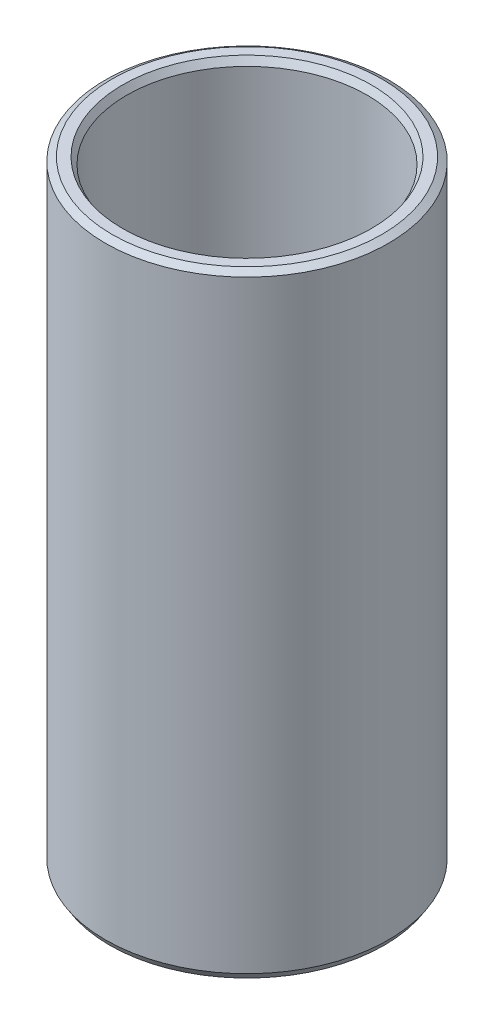
ISO-10303-21;
HEADER;
FILE_DESCRIPTION(('STEP AP214'),'2;1');
FILE_NAME('part.step','',(''),(''),'','','');
FILE_SCHEMA(('AUTOMOTIVE_DESIGN { 1 0 10303 214 1 1 1 1 }'));
ENDSEC;
DATA;
#1=APPLICATION_CONTEXT('core data for automotive mechanical design processes');
#2=APPLICATION_PROTOCOL_DEFINITION('international standard','automotive_design',2000,#1);
#3=PRODUCT_CONTEXT('',#1,'mechanical');
#4=PRODUCT('Part','Part','',(#3));
#5=PRODUCT_RELATED_PRODUCT_CATEGORY('part','',(#4));
#6=PRODUCT_DEFINITION_FORMATION('','',#4);
#7=PRODUCT_DEFINITION_CONTEXT('part definition',#1,'design');
#8=PRODUCT_DEFINITION('design','',#6,#7);
#9=PRODUCT_DEFINITION_SHAPE('','',#8);
#10=(LENGTH_UNIT() NAMED_UNIT(*) SI_UNIT(.MILLI.,.METRE.));
#11=(NAMED_UNIT(*) PLANE_ANGLE_UNIT() SI_UNIT($,.RADIAN.));
#12=(NAMED_UNIT(*) SI_UNIT($,.STERADIAN.) SOLID_ANGLE_UNIT());
#13=UNCERTAINTY_MEASURE_WITH_UNIT(LENGTH_MEASURE(1.E-05),#10,'distance_accuracy_value','');
#14=(GEOMETRIC_REPRESENTATION_CONTEXT(3) GLOBAL_UNCERTAINTY_ASSIGNED_CONTEXT((#13)) GLOBAL_UNIT_ASSIGNED_CONTEXT((#10,
#11,#12)) REPRESENTATION_CONTEXT('',''));
#15=CARTESIAN_POINT('',(0.,0.,0.));
#16=DIRECTION('',(0.,0.,1.));
#17=DIRECTION('',(1.,0.,0.));
#18=AXIS2_PLACEMENT_3D('',#15,#16,#17);
#19=CARTESIAN_POINT('',(0.,97.6144153267064,0.));
#20=DIRECTION('',(0.,-1.,0.));
#21=DIRECTION('',(0.,0.,-1.));
#22=AXIS2_PLACEMENT_3D('',#19,#20,#21);
#23=CYLINDRICAL_SURFACE('',#22,22.5);
#24=CARTESIAN_POINT('',(0.,1.0770015775569,0.));
#25=DIRECTION('',(0.,1.,0.));
#26=DIRECTION('',(0.,0.,1.));
#27=AXIS2_PLACEMENT_3D('',#24,#25,#26);
#28=CIRCLE('',#27,22.5);
#29=CARTESIAN_POINT('',(0.,1.07700157755689,-22.5));
#30=VERTEX_POINT('',#29);
#31=EDGE_CURVE('E10',#30,#30,#28,.T.);
#32=CARTESIAN_POINT('',(0.,96.9454273169921,0.));
#33=DIRECTION('',(0.,1.,0.));
#34=DIRECTION('',(0.,0.,1.));
#35=AXIS2_PLACEMENT_3D('',#32,#33,#34);
#36=CIRCLE('',#35,22.5);
#37=CARTESIAN_POINT('',(0.,96.9454273169921,-22.5));
#38=VERTEX_POINT('',#37);
#39=EDGE_CURVE('E50',#38,#38,#36,.F.);
#40=CARTESIAN_POINT('',(0.,1.07700157755689,-22.5));
#41=CARTESIAN_POINT('',(0.,2.07563101234267,-22.5));
#42=CARTESIAN_POINT('',(0.,3.07426044712845,-22.5));
#43=CARTESIAN_POINT('',(0.,5.07151931670001,-22.5));
#44=CARTESIAN_POINT('',(0.,6.0701487514858,-22.5));
#45=CARTESIAN_POINT('',(0.,8.06740762105736,-22.5));
#46=CARTESIAN_POINT('',(0.,9.06603705584314,-22.5));
#47=CARTESIAN_POINT('',(0.,11.0632959254147,-22.5));
#48=CARTESIAN_POINT('',(0.,12.0619253602005,-22.5));
#49=CARTESIAN_POINT('',(0.,14.0591842297721,-22.5));
#50=CARTESIAN_POINT('',(0.,15.0578136645579,-22.5));
#51=CARTESIAN_POINT('',(0.,17.0550725341294,-22.5));
#52=CARTESIAN_POINT('',(0.,18.0537019689152,-22.5));
#53=CARTESIAN_POINT('',(0.,20.0509608384868,-22.5));
#54=CARTESIAN_POINT('',(0.,21.0495902732725,-22.5));
#55=CARTESIAN_POINT('',(0.,23.0468491428441,-22.5));
#56=CARTESIAN_POINT('',(0.,24.0454785776299,-22.5));
#57=CARTESIAN_POINT('',(0.,26.0427374472015,-22.5));
#58=CARTESIAN_POINT('',(0.,27.0413668819873,-22.5));
#59=CARTESIAN_POINT('',(0.,29.0386257515588,-22.5));
#60=CARTESIAN_POINT('',(0.,30.0372551863446,-22.5));
#61=CARTESIAN_POINT('',(0.,32.0345140559162,-22.5));
#62=CARTESIAN_POINT('',(0.,33.0331434907019,-22.5));
#63=CARTESIAN_POINT('',(0.,35.0304023602735,-22.5));
#64=CARTESIAN_POINT('',(0.,36.0290317950593,-22.5));
#65=CARTESIAN_POINT('',(0.,38.0262906646309,-22.5));
#66=CARTESIAN_POINT('',(0.,39.0249200994166,-22.5));
#67=CARTESIAN_POINT('',(0.,41.0221789689882,-22.5));
#68=CARTESIAN_POINT('',(0.,42.020808403774,-22.5));
#69=CARTESIAN_POINT('',(0.,44.0180672733456,-22.5));
#70=CARTESIAN_POINT('',(0.,45.0166967081313,-22.5));
#71=CARTESIAN_POINT('',(0.,47.0139555777029,-22.5));
#72=CARTESIAN_POINT('',(0.,48.0125850124887,-22.5));
#73=CARTESIAN_POINT('',(0.,50.0098438820603,-22.5));
#74=CARTESIAN_POINT('',(0.,51.008473316846,-22.5));
#75=CARTESIAN_POINT('',(0.,53.0057321864176,-22.5));
#76=CARTESIAN_POINT('',(0.,54.0043616212034,-22.5));
#77=CARTESIAN_POINT('',(0.,56.001620490775,-22.5));
#78=CARTESIAN_POINT('',(0.,57.0002499255607,-22.5));
#79=CARTESIAN_POINT('',(0.,58.9975087951323,-22.5));
#80=CARTESIAN_POINT('',(0.,59.9961382299181,-22.5));
#81=CARTESIAN_POINT('',(0.,61.9933970994897,-22.5));
#82=CARTESIAN_POINT('',(0.,62.9920265342754,-22.5));
#83=CARTESIAN_POINT('',(0.,64.989285403847,-22.5));
#84=CARTESIAN_POINT('',(0.,65.9879148386328,-22.5));
#85=CARTESIAN_POINT('',(0.,67.9851737082043,-22.5));
#86=CARTESIAN_POINT('',(0.,68.9838031429901,-22.5));
#87=CARTESIAN_POINT('',(0.,70.9810620125617,-22.5));
#88=CARTESIAN_POINT('',(0.,71.9796914473475,-22.5));
#89=CARTESIAN_POINT('',(0.,73.976950316919,-22.5));
#90=CARTESIAN_POINT('',(0.,74.9755797517048,-22.5));
#91=CARTESIAN_POINT('',(0.,76.9728386212764,-22.5));
#92=CARTESIAN_POINT('',(0.,77.9714680560622,-22.5));
#93=CARTESIAN_POINT('',(0.,79.9687269256337,-22.5));
#94=CARTESIAN_POINT('',(0.,80.9673563604195,-22.5));
#95=CARTESIAN_POINT('',(0.,82.9646152299911,-22.5));
#96=CARTESIAN_POINT('',(0.,83.9632446647769,-22.5));
#97=CARTESIAN_POINT('',(0.,85.9605035343484,-22.5));
#98=CARTESIAN_POINT('',(0.,86.9591329691342,-22.5));
#99=CARTESIAN_POINT('',(0.,88.9563918387058,-22.5));
#100=CARTESIAN_POINT('',(0.,89.9550212734916,-22.5));
#101=CARTESIAN_POINT('',(0.,91.9522801430631,-22.5));
#102=CARTESIAN_POINT('',(0.,92.9509095778489,-22.5));
#103=CARTESIAN_POINT('',(0.,94.9481684474205,-22.5));
#104=CARTESIAN_POINT('',(0.,95.9467978822063,-22.5));
#105=CARTESIAN_POINT('',(0.,96.9454273169921,-22.5));
#106=B_SPLINE_CURVE_WITH_KNOTS('',3,(#40,#41,#42,#43,#44,#45,#46,#47,#48,#49,#50,#51,#52,#53,
#54,#55,#56,#57,#58,#59,#60,#61,#62,#63,#64,#65,#66,#67,#68,#69,#70,#71,#72,#73,#74,#75,#76,#77,
#78,#79,#80,#81,#82,#83,#84,#85,#86,#87,#88,#89,#90,#91,#92,#93,#94,#95,#96,#97,#98,#99,#100,
#101,#102,#103,#104,#105),.UNSPECIFIED.,.F.,.F.,(4,2,2,2,2,2,2,2,2,2,2,2,2,2,2,2,2,2,2,2,2,2,2,
2,2,2,2,2,2,2,2,2,4),(0.,2.99588830435735,5.99177660871469,8.98766491307204,11.9835532174294,
14.9794415217867,17.9753298261441,20.9712181305014,23.9671064348588,26.9629947392161,
29.9588830435735,32.9547713479308,35.9506596522882,38.9465479566455,41.9424362610029,
44.9383245653602,47.9342128697176,50.9301011740749,53.9259894784323,56.9218777827896,
59.917766087147,62.9136543915043,65.9095426958617,68.905431000219,71.9013193045764,
74.8972076089337,77.8930959132911,80.8889842176484,83.8848725220058,86.8807608263631,
89.8766491307205,92.8725374350778,95.8684257394352),.UNSPECIFIED.);
#107=EDGE_CURVE('BSEAM39',#30,#38,#106,.T.);
#108=ORIENTED_EDGE('',*,*,#31,.T.);
#109=ORIENTED_EDGE('',*,*,#39,.T.);
#110=ORIENTED_EDGE('',*,*,#107,.T.);
#111=ORIENTED_EDGE('',*,*,#107,.F.);
#112=EDGE_LOOP('',(#108,#110,#109,#111));
#113=FACE_BOUND('',#112,.T.);
#114=ADVANCED_FACE('F39',(#113),#23,.T.);
#115=CARTESIAN_POINT('',(0.,97.6144153267064,0.));
#116=DIRECTION('',(0.,1.,0.));
#117=DIRECTION('',(0.,0.,1.));
#118=AXIS2_PLACEMENT_3D('',#115,#116,#117);
#119=PLANE('',#118);
#120=CARTESIAN_POINT('',(0.,97.6144153267064,0.));
#121=DIRECTION('',(0.,1.,0.));
#122=DIRECTION('',(0.,0.,1.));
#123=AXIS2_PLACEMENT_3D('',#120,#121,#122);
#124=CIRCLE('',#123,19.7793494607597);
#125=CARTESIAN_POINT('',(0.,97.6144153267064,19.7793494607597));
#126=VERTEX_POINT('',#125);
#127=EDGE_CURVE('E58',#126,#126,#124,.F.);
#128=ORIENTED_EDGE('',*,*,#127,.T.);
#129=EDGE_LOOP('',(#128));
#130=FACE_BOUND('',#129,.T.);
#131=CARTESIAN_POINT('',(0.,97.6144153267064,0.));
#132=DIRECTION('',(0.,1.,0.));
#133=DIRECTION('',(0.,0.,1.));
#134=AXIS2_PLACEMENT_3D('',#131,#132,#133);
#135=CIRCLE('',#134,21.4229984224433);
#136=CARTESIAN_POINT('',(0.,97.6144153267064,-21.4229984224433));
#137=VERTEX_POINT('',#136);
#138=EDGE_CURVE('E61',#137,#137,#135,.T.);
#139=ORIENTED_EDGE('',*,*,#138,.T.);
#140=EDGE_LOOP('',(#139));
#141=FACE_BOUND('',#140,.T.);
#142=ADVANCED_FACE('F88',(#130,#141),#119,.T.);
#143=CARTESIAN_POINT('',(0.,0.,0.));
#144=DIRECTION('',(0.,1.,0.));
#145=DIRECTION('',(0.,0.,1.));
#146=AXIS2_PLACEMENT_3D('',#143,#144,#145);
#147=PLANE('',#146);
#148=CARTESIAN_POINT('',(0.,0.,0.));
#149=DIRECTION('',(0.,1.,0.));
#150=DIRECTION('',(0.,0.,1.));
#151=AXIS2_PLACEMENT_3D('',#148,#149,#150);
#152=CIRCLE('',#151,20.1873630286019);
#153=CARTESIAN_POINT('',(0.,0.,20.1873630286019));
#154=VERTEX_POINT('',#153);
#155=EDGE_CURVE('E51',#154,#154,#152,.T.);
#156=ORIENTED_EDGE('',*,*,#155,.T.);
#157=EDGE_LOOP('',(#156));
#158=FACE_BOUND('',#157,.T.);
#159=CARTESIAN_POINT('',(0.,0.,0.));
#160=DIRECTION('',(0.,1.,0.));
#161=DIRECTION('',(0.,0.,1.));
#162=AXIS2_PLACEMENT_3D('',#159,#160,#161);
#163=CIRCLE('',#162,21.8310119902855);
#164=CARTESIAN_POINT('',(0.,0.,21.8310119902855));
#165=VERTEX_POINT('',#164);
#166=EDGE_CURVE('E54',#165,#165,#163,.F.);
#167=ORIENTED_EDGE('',*,*,#166,.T.);
#168=EDGE_LOOP('',(#167));
#169=FACE_BOUND('',#168,.T.);
#170=ADVANCED_FACE('F83',(#158,#169),#147,.F.);
#171=CARTESIAN_POINT('',(0.,97.6144153267064,0.));
#172=DIRECTION('',(0.,-1.,0.));
#173=DIRECTION('',(0.,0.,-1.));
#174=AXIS2_PLACEMENT_3D('',#171,#172,#173);
#175=CYLINDRICAL_SURFACE('',#174,19.1103614510452);
#176=CARTESIAN_POINT('',(0.,96.5374137491494,0.));
#177=DIRECTION('',(0.,1.,0.));
#178=DIRECTION('',(0.,0.,1.));
#179=AXIS2_PLACEMENT_3D('',#176,#177,#178);
#180=CIRCLE('',#179,19.1103614510452);
#181=CARTESIAN_POINT('',(0.,96.5374137491494,-19.1103614510452));
#182=VERTEX_POINT('',#181);
#183=EDGE_CURVE('E67',#182,#182,#180,.T.);
#184=CARTESIAN_POINT('',(0.,0.668988009714391,0.));
#185=DIRECTION('',(0.,1.,0.));
#186=DIRECTION('',(0.,0.,1.));
#187=AXIS2_PLACEMENT_3D('',#184,#185,#186);
#188=CIRCLE('',#187,19.1103614510452);
#189=CARTESIAN_POINT('',(0.,0.668988009714377,-19.1103614510452));
#190=VERTEX_POINT('',#189);
#191=EDGE_CURVE('E69',#190,#190,#188,.F.);
#192=CARTESIAN_POINT('',(0.,96.5374137491494,-19.1103614510452));
#193=CARTESIAN_POINT('',(0.,95.5387843143637,-19.1103614510452));
#194=CARTESIAN_POINT('',(0.,94.5401548795779,-19.1103614510452));
#195=CARTESIAN_POINT('',(0.,92.5428960100063,-19.1103614510452));
#196=CARTESIAN_POINT('',(0.,91.5442665752205,-19.1103614510452));
#197=CARTESIAN_POINT('',(0.,89.547007705649,-19.1103614510452));
#198=CARTESIAN_POINT('',(0.,88.5483782708632,-19.1103614510452));
#199=CARTESIAN_POINT('',(0.,86.5511194012916,-19.1103614510452));
#200=CARTESIAN_POINT('',(0.,85.5524899665058,-19.1103614510452));
#201=CARTESIAN_POINT('',(0.,83.5552310969343,-19.1103614510452));
#202=CARTESIAN_POINT('',(0.,82.5566016621485,-19.1103614510452));
#203=CARTESIAN_POINT('',(0.,80.5593427925769,-19.1103614510452));
#204=CARTESIAN_POINT('',(0.,79.5607133577911,-19.1103614510452));
#205=CARTESIAN_POINT('',(0.,77.5634544882196,-19.1103614510452));
#206=CARTESIAN_POINT('',(0.,76.5648250534338,-19.1103614510452));
#207=CARTESIAN_POINT('',(0.,74.5675661838622,-19.1103614510452));
#208=CARTESIAN_POINT('',(0.,73.5689367490764,-19.1103614510452));
#209=CARTESIAN_POINT('',(0.,71.5716778795049,-19.1103614510452));
#210=CARTESIAN_POINT('',(0.,70.5730484447191,-19.1103614510452));
#211=CARTESIAN_POINT('',(0.,68.5757895751475,-19.1103614510452));
#212=CARTESIAN_POINT('',(0.,67.5771601403617,-19.1103614510452));
#213=CARTESIAN_POINT('',(0.,65.5799012707902,-19.1103614510452));
#214=CARTESIAN_POINT('',(0.,64.5812718360044,-19.1103614510452));
#215=CARTESIAN_POINT('',(0.,62.5840129664329,-19.1103614510452));
#216=CARTESIAN_POINT('',(0.,61.5853835316471,-19.1103614510452));
#217=CARTESIAN_POINT('',(0.,59.5881246620755,-19.1103614510452));
#218=CARTESIAN_POINT('',(0.,58.5894952272897,-19.1103614510452));
#219=CARTESIAN_POINT('',(0.,56.5922363577182,-19.1103614510452));
#220=CARTESIAN_POINT('',(0.,55.5936069229324,-19.1103614510452));
#221=CARTESIAN_POINT('',(0.,53.5963480533608,-19.1103614510452));
#222=CARTESIAN_POINT('',(0.,52.597718618575,-19.1103614510452));
#223=CARTESIAN_POINT('',(0.,50.6004597490035,-19.1103614510452));
#224=CARTESIAN_POINT('',(0.,49.6018303142177,-19.1103614510452));
#225=CARTESIAN_POINT('',(0.,47.6045714446461,-19.1103614510452));
#226=CARTESIAN_POINT('',(0.,46.6059420098603,-19.1103614510452));
#227=CARTESIAN_POINT('',(0.,44.6086831402888,-19.1103614510452));
#228=CARTESIAN_POINT('',(0.,43.610053705503,-19.1103614510452));
#229=CARTESIAN_POINT('',(0.,41.6127948359314,-19.1103614510452));
#230=CARTESIAN_POINT('',(0.,40.6141654011456,-19.1103614510452));
#231=CARTESIAN_POINT('',(0.,38.6169065315741,-19.1103614510452));
#232=CARTESIAN_POINT('',(0.,37.6182770967883,-19.1103614510452));
#233=CARTESIAN_POINT('',(0.,35.6210182272167,-19.1103614510452));
#234=CARTESIAN_POINT('',(0.,34.622388792431,-19.1103614510452));
#235=CARTESIAN_POINT('',(0.,32.6251299228594,-19.1103614510452));
#236=CARTESIAN_POINT('',(0.,31.6265004880736,-19.1103614510452));
#237=CARTESIAN_POINT('',(0.,29.629241618502,-19.1103614510452));
#238=CARTESIAN_POINT('',(0.,28.6306121837163,-19.1103614510452));
#239=CARTESIAN_POINT('',(0.,26.6333533141447,-19.1103614510452));
#240=CARTESIAN_POINT('',(0.,25.6347238793589,-19.1103614510452));
#241=CARTESIAN_POINT('',(0.,23.6374650097874,-19.1103614510452));
#242=CARTESIAN_POINT('',(0.,22.6388355750016,-19.1103614510452));
#243=CARTESIAN_POINT('',(0.,20.64157670543,-19.1103614510452));
#244=CARTESIAN_POINT('',(0.,19.6429472706442,-19.1103614510452));
#245=CARTESIAN_POINT('',(0.,17.6456884010727,-19.1103614510452));
#246=CARTESIAN_POINT('',(0.,16.6470589662869,-19.1103614510452));
#247=CARTESIAN_POINT('',(0.,14.6498000967153,-19.1103614510452));
#248=CARTESIAN_POINT('',(0.,13.6511706619295,-19.1103614510452));
#249=CARTESIAN_POINT('',(0.,11.653911792358,-19.1103614510452));
#250=CARTESIAN_POINT('',(0.,10.6552823575722,-19.1103614510452));
#251=CARTESIAN_POINT('',(0.,8.65802348800064,-19.1103614510452));
#252=CARTESIAN_POINT('',(0.,7.65939405321485,-19.1103614510452));
#253=CARTESIAN_POINT('',(0.,5.66213518364329,-19.1103614510452));
#254=CARTESIAN_POINT('',(0.,4.66350574885751,-19.1103614510452));
#255=CARTESIAN_POINT('',(0.,2.66624687928594,-19.1103614510452));
#256=CARTESIAN_POINT('',(0.,1.66761744450016,-19.1103614510452));
#257=CARTESIAN_POINT('',(0.,0.668988009714377,-19.1103614510452));
#258=B_SPLINE_CURVE_WITH_KNOTS('',3,(#192,#193,#194,#195,#196,#197,#198,#199,#200,#201,#202,
#203,#204,#205,#206,#207,#208,#209,#210,#211,#212,#213,#214,#215,#216,#217,#218,#219,#220,#221,
#222,#223,#224,#225,#226,#227,#228,#229,#230,#231,#232,#233,#234,#235,#236,#237,#238,#239,#240,
#241,#242,#243,#244,#245,#246,#247,#248,#249,#250,#251,#252,#253,#254,#255,#256,#257),
.UNSPECIFIED.,.F.,.F.,(4,2,2,2,2,2,2,2,2,2,2,2,2,2,2,2,2,2,2,2,2,2,2,2,2,2,2,2,2,2,2,2,4),(0.,
2.99588830435735,5.99177660871469,8.98766491307204,11.9835532174294,14.9794415217867,
17.9753298261441,20.9712181305014,23.9671064348588,26.9629947392161,29.9588830435735,
32.9547713479308,35.9506596522882,38.9465479566455,41.9424362610028,44.9383245653602,
47.9342128697175,50.9301011740749,53.9259894784322,56.9218777827896,59.9177660871469,
62.9136543915043,65.9095426958616,68.905431000219,71.9013193045763,74.8972076089336,
77.893095913291,80.8889842176483,83.8848725220057,86.880760826363,89.8766491307204,
92.8725374350777,95.8684257394351),.UNSPECIFIED.);
#259=EDGE_CURVE('BSEAM71',#182,#190,#258,.T.);
#260=ORIENTED_EDGE('',*,*,#183,.T.);
#261=ORIENTED_EDGE('',*,*,#191,.T.);
#262=ORIENTED_EDGE('',*,*,#259,.T.);
#263=ORIENTED_EDGE('',*,*,#259,.F.);
#264=EDGE_LOOP('',(#260,#262,#261,#263));
#265=FACE_BOUND('',#264,.T.);
#266=ADVANCED_FACE('F71',(#265),#175,.F.);
#267=CARTESIAN_POINT('',(0.,96.5374137491494,0.));
#268=DIRECTION('',(0.,1.,0.));
#269=DIRECTION('',(0.,0.,1.));
#270=AXIS2_PLACEMENT_3D('',#267,#268,#269);
#271=CONICAL_SURFACE('',#270,19.1103614510452,0.555831665770734);
#272=ORIENTED_EDGE('',*,*,#127,.F.);
#273=EDGE_LOOP('',(#272));
#274=FACE_BOUND('',#273,.T.);
#275=ORIENTED_EDGE('',*,*,#183,.F.);
#276=EDGE_LOOP('',(#275));
#277=FACE_BOUND('',#276,.T.);
#278=ADVANCED_FACE('F77',(#274,#277),#271,.F.);
#279=CARTESIAN_POINT('',(0.,0.,0.));
#280=DIRECTION('',(0.,-1.,0.));
#281=DIRECTION('',(0.,0.,-1.));
#282=AXIS2_PLACEMENT_3D('',#279,#280,#281);
#283=CONICAL_SURFACE('',#282,20.1873630286019,1.01496466102415);
#284=ORIENTED_EDGE('',*,*,#191,.F.);
#285=EDGE_LOOP('',(#284));
#286=FACE_BOUND('',#285,.T.);
#287=ORIENTED_EDGE('',*,*,#155,.F.);
#288=EDGE_LOOP('',(#287));
#289=FACE_BOUND('',#288,.T.);
#290=ADVANCED_FACE('F73',(#286,#289),#283,.F.);
#291=CARTESIAN_POINT('',(0.,1.0770015775569,0.));
#292=DIRECTION('',(0.,1.,0.));
#293=DIRECTION('',(0.,0.,1.));
#294=AXIS2_PLACEMENT_3D('',#291,#292,#293);
#295=CONICAL_SURFACE('',#294,22.5,0.55583166577074);
#296=ORIENTED_EDGE('',*,*,#166,.F.);
#297=EDGE_LOOP('',(#296));
#298=FACE_BOUND('',#297,.T.);
#299=ORIENTED_EDGE('',*,*,#31,.F.);
#300=EDGE_LOOP('',(#299));
#301=FACE_BOUND('',#300,.T.);
#302=ADVANCED_FACE('F76',(#298,#301),#295,.T.);
#303=CARTESIAN_POINT('',(0.,97.6144153267064,0.));
#304=DIRECTION('',(0.,-1.,0.));
#305=DIRECTION('',(0.,0.,-1.));
#306=AXIS2_PLACEMENT_3D('',#303,#304,#305);
#307=CONICAL_SURFACE('',#306,21.4229984224433,1.01496466102414);
#308=CARTESIAN_POINT('',(0.,96.9454273169921,-22.5));
#309=CARTESIAN_POINT('',(0.,96.9523959420932,-22.4887812335671));
#310=CARTESIAN_POINT('',(0.,96.9593645671944,-22.4775624671342));
#311=CARTESIAN_POINT('',(0.,96.9733018173968,-22.4551249342685));
#312=CARTESIAN_POINT('',(0.,96.980270442498,-22.4439061678356));
#313=CARTESIAN_POINT('',(0.,96.9942076927004,-22.4214686349698));
#314=CARTESIAN_POINT('',(0.,97.0011763178016,-22.410249868537));
#315=CARTESIAN_POINT('',(0.,97.015113568004,-22.3878123356712));
#316=CARTESIAN_POINT('',(0.,97.0220821931052,-22.3765935692383));
#317=CARTESIAN_POINT('',(0.,97.0360194433075,-22.3541560363725));
#318=CARTESIAN_POINT('',(0.,97.0429880684087,-22.3429372699397));
#319=CARTESIAN_POINT('',(0.,97.0569253186111,-22.3204997370739));
#320=CARTESIAN_POINT('',(0.,97.0638939437123,-22.309280970641));
#321=CARTESIAN_POINT('',(0.,97.0778311939147,-22.2868434377752));
#322=CARTESIAN_POINT('',(0.,97.0847998190159,-22.2756246713424));
#323=CARTESIAN_POINT('',(0.,97.0987370692183,-22.2531871384766));
#324=CARTESIAN_POINT('',(0.,97.1057056943195,-22.2419683720437));
#325=CARTESIAN_POINT('',(0.,97.1196429445218,-22.2195308391779));
#326=CARTESIAN_POINT('',(0.,97.126611569623,-22.2083120727451));
#327=CARTESIAN_POINT('',(0.,97.1405488198254,-22.1858745398793));
#328=CARTESIAN_POINT('',(0.,97.1475174449266,-22.1746557734464));
#329=CARTESIAN_POINT('',(0.,97.161454695129,-22.1522182405807));
#330=CARTESIAN_POINT('',(0.,97.1684233202302,-22.1409994741478));
#331=CARTESIAN_POINT('',(0.,97.1823605704326,-22.118561941282));
#332=CARTESIAN_POINT('',(0.,97.1893291955338,-22.1073431748491));
#333=CARTESIAN_POINT('',(0.,97.2032664457361,-22.0849056419834));
#334=CARTESIAN_POINT('',(0.,97.2102350708373,-22.0736868755505));
#335=CARTESIAN_POINT('',(0.,97.2241723210397,-22.0512493426847));
#336=CARTESIAN_POINT('',(0.,97.2311409461409,-22.0400305762518));
#337=CARTESIAN_POINT('',(0.,97.2450781963433,-22.0175930433861));
#338=CARTESIAN_POINT('',(0.,97.2520468214445,-22.0063742769532));
#339=CARTESIAN_POINT('',(0.,97.2659840716469,-21.9839367440874));
#340=CARTESIAN_POINT('',(0.,97.2729526967481,-21.9727179776545));
#341=CARTESIAN_POINT('',(0.,97.2868899469504,-21.9502804447888));
#342=CARTESIAN_POINT('',(0.,97.2938585720516,-21.9390616783559));
#343=CARTESIAN_POINT('',(0.,97.307795822254,-21.9166241454901));
#344=CARTESIAN_POINT('',(0.,97.3147644473552,-21.9054053790572));
#345=CARTESIAN_POINT('',(0.,97.3287016975576,-21.8829678461915));
#346=CARTESIAN_POINT('',(0.,97.3356703226588,-21.8717490797586));
#347=CARTESIAN_POINT('',(0.,97.3496075728611,-21.8493115468928));
#348=CARTESIAN_POINT('',(0.,97.3565761979624,-21.8380927804599));
#349=CARTESIAN_POINT('',(0.,97.3705134481647,-21.8156552475942));
#350=CARTESIAN_POINT('',(0.,97.3774820732659,-21.8044364811613));
#351=CARTESIAN_POINT('',(0.,97.3914193234683,-21.7819989482955));
#352=CARTESIAN_POINT('',(0.,97.3983879485695,-21.7707801818626));
#353=CARTESIAN_POINT('',(0.,97.4123251987719,-21.7483426489969));
#354=CARTESIAN_POINT('',(0.,97.4192938238731,-21.737123882564));
#355=CARTESIAN_POINT('',(0.,97.4332310740755,-21.7146863496982));
#356=CARTESIAN_POINT('',(0.,97.4401996991766,-21.7034675832653));
#357=CARTESIAN_POINT('',(0.,97.454136949379,-21.6810300503996));
#358=CARTESIAN_POINT('',(0.,97.4611055744802,-21.6698112839667));
#359=CARTESIAN_POINT('',(0.,97.4750428246826,-21.6473737511009));
#360=CARTESIAN_POINT('',(0.,97.4820114497838,-21.636154984668));
#361=CARTESIAN_POINT('',(0.,97.4959486999862,-21.6137174518023));
#362=CARTESIAN_POINT('',(0.,97.5029173250874,-21.6024986853694));
#363=CARTESIAN_POINT('',(0.,97.5168545752897,-21.5800611525036));
#364=CARTESIAN_POINT('',(0.,97.523823200391,-21.5688423860708));
#365=CARTESIAN_POINT('',(0.,97.5377604505933,-21.546404853205));
#366=CARTESIAN_POINT('',(0.,97.5447290756945,-21.5351860867721));
#367=CARTESIAN_POINT('',(0.,97.5586663258969,-21.5127485539063));
#368=CARTESIAN_POINT('',(0.,97.5656349509981,-21.5015297874735));
#369=CARTESIAN_POINT('',(0.,97.5795722012005,-21.4790922546077));
#370=CARTESIAN_POINT('',(0.,97.5865408263017,-21.4678734881748));
#371=CARTESIAN_POINT('',(0.,97.600478076504,-21.445435955309));
#372=CARTESIAN_POINT('',(0.,97.6074467016052,-21.4342171888762));
#373=CARTESIAN_POINT('',(0.,97.6144153267064,-21.4229984224433));
#374=B_SPLINE_CURVE_WITH_KNOTS('',3,(#308,#309,#310,#311,#312,#313,#314,#315,#316,#317,#318,
#319,#320,#321,#322,#323,#324,#325,#326,#327,#328,#329,#330,#331,#332,#333,#334,#335,#336,#337,
#338,#339,#340,#341,#342,#343,#344,#345,#346,#347,#348,#349,#350,#351,#352,#353,#354,#355,#356,
#357,#358,#359,#360,#361,#362,#363,#364,#365,#366,#367,#368,#369,#370,#371,#372,#373),
.UNSPECIFIED.,.F.,.F.,(4,2,2,2,2,2,2,2,2,2,2,2,2,2,2,2,2,2,2,2,2,2,2,2,2,2,2,2,2,2,2,2,4),(0.,
0.0396207282200681,0.0792414564401436,0.118862184660209,0.158482912880284,0.198103641100352,
0.237724369320428,0.277345097540496,0.316965825760571,0.35658655398064,0.396207282200715,
0.43582801042078,0.475448738640856,0.515069466860924,0.554690195080999,0.594310923301067,
0.633931651521143,0.673552379741211,0.713173107961287,0.752793836181352,0.792414564401427,
0.832035292621495,0.871656020841571,0.911276749061639,0.950897477281714,0.990518205501782,
1.03013893372186,1.06975966194192,1.109380390162,1.14900111838207,1.18862184660214,
1.22824257482221,1.26786330304229),.UNSPECIFIED.);
#375=EDGE_CURVE('BSEAM45',#38,#137,#374,.T.);
#376=ORIENTED_EDGE('',*,*,#39,.F.);
#377=ORIENTED_EDGE('',*,*,#138,.F.);
#378=ORIENTED_EDGE('',*,*,#375,.T.);
#379=ORIENTED_EDGE('',*,*,#375,.F.);
#380=EDGE_LOOP('',(#376,#378,#377,#379));
#381=FACE_BOUND('',#380,.T.);
#382=ADVANCED_FACE('F45',(#381),#307,.T.);
#383=CLOSED_SHELL('',(#114,#142,#170,#266,#278,#290,#302,#382));
#384=MANIFOLD_SOLID_BREP('B2',#383);
#385=ADVANCED_BREP_SHAPE_REPRESENTATION('',(#18,#384),#14);
#386=SHAPE_DEFINITION_REPRESENTATION(#9,#385);
ENDSEC;
END-ISO-10303-21;
